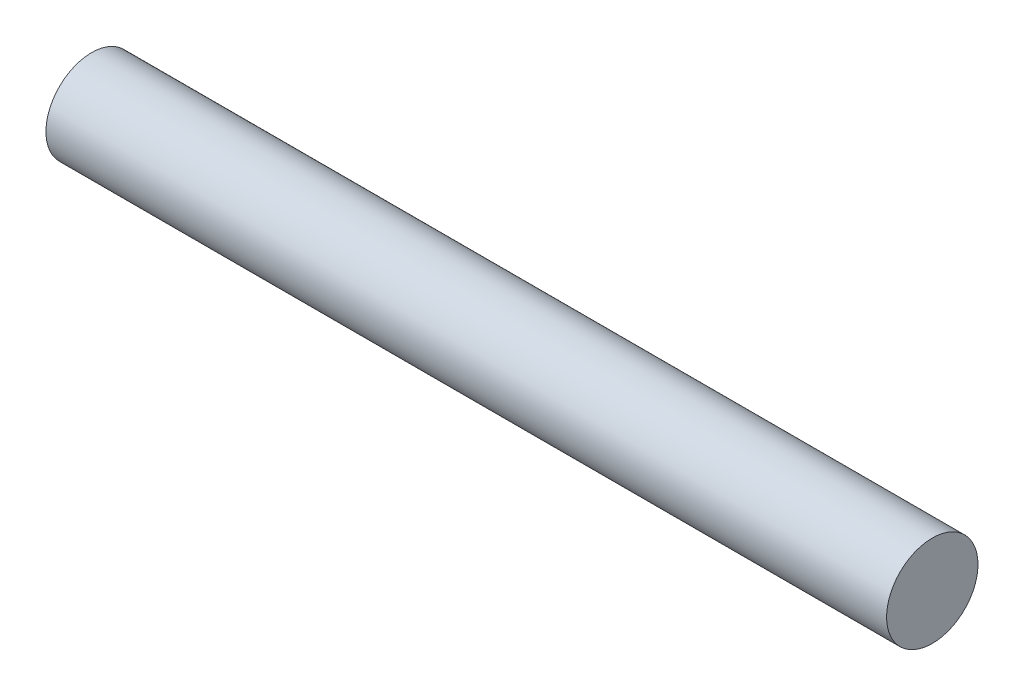
ISO-10303-21;
HEADER;
FILE_DESCRIPTION(('STEP AP214'),'2;1');
FILE_NAME('part.step','',(''),(''),'','','');
FILE_SCHEMA(('AUTOMOTIVE_DESIGN { 1 0 10303 214 1 1 1 1 }'));
ENDSEC;
DATA;
#1=APPLICATION_CONTEXT('core data for automotive mechanical design processes');
#2=APPLICATION_PROTOCOL_DEFINITION('international standard','automotive_design',2000,#1);
#3=PRODUCT_CONTEXT('',#1,'mechanical');
#4=PRODUCT('Part','Part','',(#3));
#5=PRODUCT_RELATED_PRODUCT_CATEGORY('part','',(#4));
#6=PRODUCT_DEFINITION_FORMATION('','',#4);
#7=PRODUCT_DEFINITION_CONTEXT('part definition',#1,'design');
#8=PRODUCT_DEFINITION('design','',#6,#7);
#9=PRODUCT_DEFINITION_SHAPE('','',#8);
#10=(LENGTH_UNIT() NAMED_UNIT(*) SI_UNIT(.MILLI.,.METRE.));
#11=(NAMED_UNIT(*) PLANE_ANGLE_UNIT() SI_UNIT($,.RADIAN.));
#12=(NAMED_UNIT(*) SI_UNIT($,.STERADIAN.) SOLID_ANGLE_UNIT());
#13=UNCERTAINTY_MEASURE_WITH_UNIT(LENGTH_MEASURE(1.E-05),#10,'distance_accuracy_value','');
#14=(GEOMETRIC_REPRESENTATION_CONTEXT(3) GLOBAL_UNCERTAINTY_ASSIGNED_CONTEXT((#13)) GLOBAL_UNIT_ASSIGNED_CONTEXT((#10,
#11,#12)) REPRESENTATION_CONTEXT('',''));
#15=CARTESIAN_POINT('',(0.,0.,0.));
#16=DIRECTION('',(0.,0.,1.));
#17=DIRECTION('',(1.,0.,0.));
#18=AXIS2_PLACEMENT_3D('',#15,#16,#17);
#19=CARTESIAN_POINT('',(23.,0.,0.));
#20=DIRECTION('',(-1.,0.,0.));
#21=DIRECTION('',(0.,0.,1.));
#22=AXIS2_PLACEMENT_3D('',#19,#20,#21);
#23=CYLINDRICAL_SURFACE('',#22,1.25);
#24=CARTESIAN_POINT('',(23.,0.,0.));
#25=DIRECTION('',(1.,0.,0.));
#26=DIRECTION('',(0.,0.,-1.));
#27=AXIS2_PLACEMENT_3D('',#24,#25,#26);
#28=CIRCLE('',#27,1.25);
#29=CARTESIAN_POINT('',(23.,0.,-1.25));
#30=VERTEX_POINT('',#29);
#31=EDGE_CURVE('E10',#30,#30,#28,.T.);
#32=ORIENTED_EDGE('',*,*,#31,.F.);
#33=EDGE_LOOP('',(#32));
#34=FACE_BOUND('',#33,.T.);
#35=CARTESIAN_POINT('',(0.,0.,0.));
#36=DIRECTION('',(1.,0.,0.));
#37=DIRECTION('',(0.,0.,-1.));
#38=AXIS2_PLACEMENT_3D('',#35,#36,#37);
#39=CIRCLE('',#38,1.25);
#40=CARTESIAN_POINT('',(0.,0.,-1.25));
#41=VERTEX_POINT('',#40);
#42=EDGE_CURVE('E33',#41,#41,#39,.T.);
#43=ORIENTED_EDGE('',*,*,#42,.T.);
#44=EDGE_LOOP('',(#43));
#45=FACE_BOUND('',#44,.T.);
#46=ADVANCED_FACE('F30',(#34,#45),#23,.T.);
#47=CARTESIAN_POINT('',(23.,0.,0.));
#48=DIRECTION('',(1.,0.,0.));
#49=DIRECTION('',(0.,0.,-1.));
#50=AXIS2_PLACEMENT_3D('',#47,#48,#49);
#51=PLANE('',#50);
#52=ORIENTED_EDGE('',*,*,#31,.T.);
#53=EDGE_LOOP('',(#52));
#54=FACE_BOUND('',#53,.T.);
#55=ADVANCED_FACE('F45',(#54),#51,.T.);
#56=CARTESIAN_POINT('',(0.,0.,0.));
#57=DIRECTION('',(1.,0.,0.));
#58=DIRECTION('',(0.,0.,-1.));
#59=AXIS2_PLACEMENT_3D('',#56,#57,#58);
#60=PLANE('',#59);
#61=ORIENTED_EDGE('',*,*,#42,.F.);
#62=EDGE_LOOP('',(#61));
#63=FACE_BOUND('',#62,.T.);
#64=ADVANCED_FACE('F43',(#63),#60,.F.);
#65=CLOSED_SHELL('',(#46,#55,#64));
#66=MANIFOLD_SOLID_BREP('B2',#65);
#67=ADVANCED_BREP_SHAPE_REPRESENTATION('',(#18,#66),#14);
#68=SHAPE_DEFINITION_REPRESENTATION(#9,#67);
ENDSEC;
END-ISO-10303-21;
